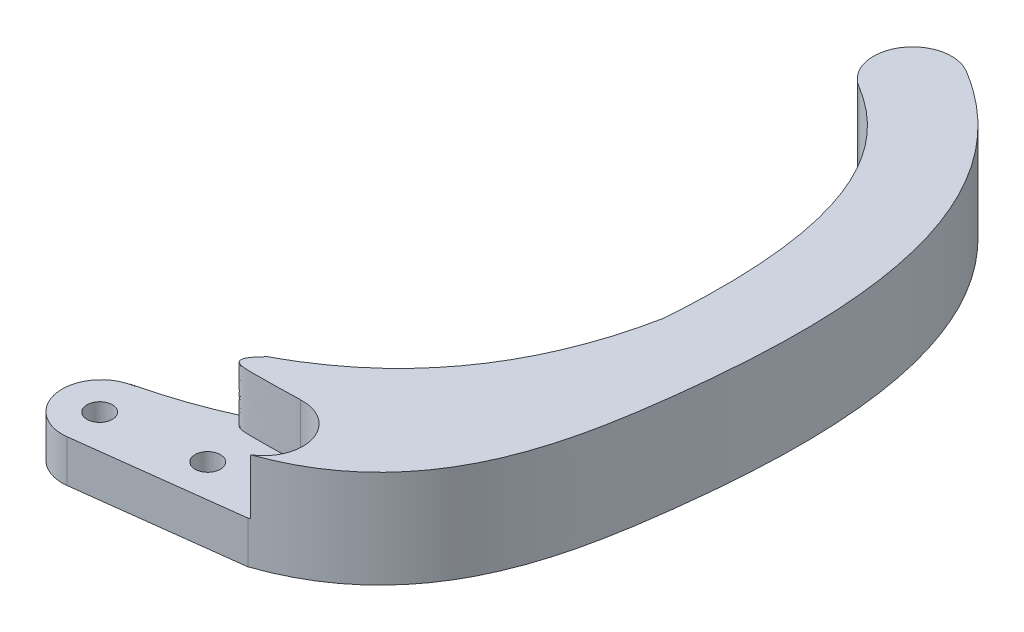
ISO-10303-21;
HEADER;
FILE_DESCRIPTION(('STEP AP214'),'2;1');
FILE_NAME('part.step','',(''),(''),'','','');
FILE_SCHEMA(('AUTOMOTIVE_DESIGN { 1 0 10303 214 1 1 1 1 }'));
ENDSEC;
DATA;
#1=APPLICATION_CONTEXT('core data for automotive mechanical design processes');
#2=APPLICATION_PROTOCOL_DEFINITION('international standard','automotive_design',2000,#1);
#3=PRODUCT_CONTEXT('',#1,'mechanical');
#4=PRODUCT('Part','Part','',(#3));
#5=PRODUCT_RELATED_PRODUCT_CATEGORY('part','',(#4));
#6=PRODUCT_DEFINITION_FORMATION('','',#4);
#7=PRODUCT_DEFINITION_CONTEXT('part definition',#1,'design');
#8=PRODUCT_DEFINITION('design','',#6,#7);
#9=PRODUCT_DEFINITION_SHAPE('','',#8);
#10=(LENGTH_UNIT() NAMED_UNIT(*) SI_UNIT(.MILLI.,.METRE.));
#11=(NAMED_UNIT(*) PLANE_ANGLE_UNIT() SI_UNIT($,.RADIAN.));
#12=(NAMED_UNIT(*) SI_UNIT($,.STERADIAN.) SOLID_ANGLE_UNIT());
#13=UNCERTAINTY_MEASURE_WITH_UNIT(LENGTH_MEASURE(1.E-05),#10,'distance_accuracy_value','');
#14=(GEOMETRIC_REPRESENTATION_CONTEXT(3) GLOBAL_UNCERTAINTY_ASSIGNED_CONTEXT((#13)) GLOBAL_UNIT_ASSIGNED_CONTEXT((#10,
#11,#12)) REPRESENTATION_CONTEXT('',''));
#15=CARTESIAN_POINT('',(0.,0.,0.));
#16=DIRECTION('',(0.,0.,1.));
#17=DIRECTION('',(1.,0.,0.));
#18=AXIS2_PLACEMENT_3D('',#15,#16,#17);
#19=CARTESIAN_POINT('',(-22.0031053075297,2.16272645112193,28.7010593362188));
#20=DIRECTION('',(0.,1.,0.));
#21=DIRECTION('',(0.,0.,1.));
#22=AXIS2_PLACEMENT_3D('',#19,#20,#21);
#23=PLANE('',#22);
#24=CARTESIAN_POINT('',(-20.0211108133601,2.16272645112193,26.7592628633793));
#25=DIRECTION('',(0.,1.,0.));
#26=DIRECTION('',(0.,0.,1.));
#27=AXIS2_PLACEMENT_3D('',#24,#25,#26);
#28=CIRCLE('',#27,0.650000000000001);
#29=CARTESIAN_POINT('',(-20.0211108133601,2.16272645112193,27.4092628633793));
#30=VERTEX_POINT('',#29);
#31=EDGE_CURVE('E208',#30,#30,#28,.T.);
#32=ORIENTED_EDGE('',*,*,#31,.F.);
#33=EDGE_LOOP('',(#32));
#34=FACE_BOUND('',#33,.T.);
#35=CARTESIAN_POINT('',(-15.04895884855,2.16272645112193,26.2047564335982));
#36=DIRECTION('',(0.,1.,0.));
#37=DIRECTION('',(0.,0.,1.));
#38=AXIS2_PLACEMENT_3D('',#35,#36,#37);
#39=CIRCLE('',#38,0.649999999999999);
#40=CARTESIAN_POINT('',(-15.04895884855,2.16272645112193,26.8547564335982));
#41=VERTEX_POINT('',#40);
#42=EDGE_CURVE('E355',#41,#41,#39,.T.);
#43=ORIENTED_EDGE('',*,*,#42,.F.);
#44=EDGE_LOOP('',(#43));
#45=FACE_BOUND('',#44,.T.);
#46=DIRECTION('',(-0.505075384915345,0.,0.863075231687607));
#47=VECTOR('',#46,1.);
#48=CARTESIAN_POINT('',(-12.4815641701559,2.16272645112193,23.7504826598374));
#49=LINE('',#48,#47);
#50=CARTESIAN_POINT('',(-12.5737473278352,2.16272645112193,23.9080056802576));
#51=VERTEX_POINT('',#50);
#52=CARTESIAN_POINT('',(-12.5808268150844,2.16272645112193,23.9201031419047));
#53=VERTEX_POINT('',#52);
#54=EDGE_CURVE('E177',#51,#53,#49,.T.);
#55=ORIENTED_EDGE('',*,*,#54,.F.);
#56=CARTESIAN_POINT('',(-15.3526385502509,2.16272645112193,22.8528473169791));
#57=CARTESIAN_POINT('',(-16.4269385478913,2.16272645112193,23.94912181987));
#58=CARTESIAN_POINT('',(-14.7009659994152,2.16272645112193,23.9638675618217));
#59=CARTESIAN_POINT('',(-13.0494889974683,2.16272645112193,23.9339152397233));
#60=CARTESIAN_POINT('',(-12.5737473278352,2.16272645112193,23.9080056802576));
#61=B_SPLINE_CURVE_WITH_KNOTS('',3,(#56,#57,#58,#59,#60),.UNSPECIFIED.,.F.,.F.,(4,1,4),(0.,
0.429888837227922,1.),.UNSPECIFIED.);
#62=CARTESIAN_POINT('',(-15.3526385503744,2.16272645112193,22.8528473170498));
#63=VERTEX_POINT('',#62);
#64=EDGE_CURVE('E148',#63,#51,#61,.T.);
#65=ORIENTED_EDGE('',*,*,#64,.F.);
#66=CARTESIAN_POINT('',(-20.4899180030866,2.16272645112194,24.7461868557851));
#67=CARTESIAN_POINT('',(-9.08556802581779,2.16272645112194,22.0034252099663));
#68=CARTESIAN_POINT('',(-6.91422073039938,2.16272645112194,11.0122515027838));
#69=B_SPLINE_CURVE_WITH_KNOTS('',2,(#66,#67,#68),.UNSPECIFIED.,.F.,.F.,(3,3),(0.,1.),.UNSPECIFIED.);
#70=CARTESIAN_POINT('',(-20.4899180030866,2.16272645112193,24.7461868557851));
#71=VERTEX_POINT('',#70);
#72=EDGE_CURVE('E218',#71,#63,#69,.T.);
#73=ORIENTED_EDGE('',*,*,#72,.F.);
#74=DIRECTION('',(-0.99235910439441,0.,0.123383175212523));
#75=VECTOR('',#74,1.);
#76=CARTESIAN_POINT('',(-20.4899180030866,2.16272645112193,24.7461868557851));
#77=LINE('',#76,#75);
#78=CARTESIAN_POINT('',(-20.2498716579538,2.16272645112193,24.7163411274297));
#79=VERTEX_POINT('',#78);
#80=EDGE_CURVE('E234',#79,#71,#77,.T.);
#81=ORIENTED_EDGE('',*,*,#80,.F.);
#82=CARTESIAN_POINT('',(-20.0031053075297,2.16272645112193,26.7010593362188));
#83=DIRECTION('',(0.,1.,0.));
#84=DIRECTION('',(0.,0.,1.));
#85=AXIS2_PLACEMENT_3D('',#82,#83,#84);
#86=CIRCLE('',#85,2.00000000000008);
#87=CARTESIAN_POINT('',(-19.7563389571046,2.16272645112193,28.6857775450076));
#88=VERTEX_POINT('',#87);
#89=EDGE_CURVE('E190',#79,#88,#86,.T.);
#90=ORIENTED_EDGE('',*,*,#89,.T.);
#91=DIRECTION('',(0.99235910439441,0.,-0.123383175212528));
#92=VECTOR('',#91,1.);
#93=CARTESIAN_POINT('',(-11.5327875652265,2.16272645112193,27.6633171496122));
#94=LINE('',#93,#92);
#95=CARTESIAN_POINT('',(-11.5327875652265,2.16272645112193,27.6633171496122));
#96=VERTEX_POINT('',#95);
#97=EDGE_CURVE('E12',#88,#96,#94,.T.);
#98=ORIENTED_EDGE('',*,*,#97,.T.);
#99=CARTESIAN_POINT('',(-11.5327875652265,2.16272645112193,27.6633171496122));
#100=CARTESIAN_POINT('',(-11.4705328840874,2.16272645112193,27.6408736134227));
#101=CARTESIAN_POINT('',(-11.3551026257132,2.16272645112193,27.5995338300038));
#102=CARTESIAN_POINT('',(-11.0516092777323,2.16272645112193,27.4884759514846));
#103=CARTESIAN_POINT('',(-10.5513437173492,2.16272645112193,27.2865539282901));
#104=CARTESIAN_POINT('',(-9.5849011476042,2.16272645112193,26.8294087655371));
#105=CARTESIAN_POINT('',(-7.85457596750125,2.16272645112193,25.725812710721));
#106=CARTESIAN_POINT('',(-5.96542890968509,2.16272645112193,23.6751103760805));
#107=CARTESIAN_POINT('',(-4.55644623408551,2.16272645112193,20.8199906366794));
#108=CARTESIAN_POINT('',(-3.73194291853068,2.16272645112193,17.7966546678477));
#109=CARTESIAN_POINT('',(-3.2575877574119,2.16272645112193,14.7429997846611));
#110=CARTESIAN_POINT('',(-2.92791896255767,2.16272645112193,11.6989351556128));
#111=CARTESIAN_POINT('',(-2.7724808230558,2.16272645112193,8.76409886953061));
#112=CARTESIAN_POINT('',(-2.84198148702445,2.16272645112193,5.20493893222024));
#113=CARTESIAN_POINT('',(-3.42508342777761,2.16272645112193,1.31817111381266));
#114=CARTESIAN_POINT('',(-4.91857020106248,2.16272645112193,-2.52848265045276));
#115=CARTESIAN_POINT('',(-7.18223334564354,2.16272645112193,-5.5753012786201));
#116=CARTESIAN_POINT('',(-9.09095939420045,2.16272645112193,-7.05327105001435));
#117=CARTESIAN_POINT('',(-10.123130175544,2.16272645112193,-7.67687423040969));
#118=B_SPLINE_CURVE_WITH_KNOTS('',3,(#99,#100,#101,#102,#103,#104,#105,#106,#107,#108,#109,#110,
#111,#112,#113,#114,#115,#116,#117),.UNSPECIFIED.,.F.,.F.,(4,1,1,1,1,1,1,1,1,1,1,1,1,1,1,1,4),
(-0.00441162090859239,-0.000488138014418203,0.00343534487975599,0.0112823106681044,
0.0269762422448011,0.0583641053981946,0.121139831704982,0.183915558011769,0.246691284318556,
0.309467010625343,0.37224273693213,0.435018463238917,0.497794189545704,0.623345642159278,
0.748897094772852,0.874448547386426,1.),.UNSPECIFIED.);
#119=CARTESIAN_POINT('',(-11.4292559025369,2.16272645112193,27.6260498510052));
#120=VERTEX_POINT('',#119);
#121=EDGE_CURVE('E193',#96,#120,#118,.T.);
#122=ORIENTED_EDGE('',*,*,#121,.T.);
#123=CARTESIAN_POINT('',(-12.4679360328548,2.16272645112193,25.9169145178958));
#124=DIRECTION('',(0.,-1.,0.));
#125=DIRECTION('',(0.,0.,1.));
#126=AXIS2_PLACEMENT_3D('',#123,#124,#125);
#127=CIRCLE('',#126,2.);
#128=EDGE_CURVE('E172',#53,#120,#127,.T.);
#129=ORIENTED_EDGE('',*,*,#128,.F.);
#130=EDGE_LOOP('',(#55,#65,#73,#81,#90,#98,#122,#129));
#131=FACE_BOUND('',#130,.T.);
#132=ADVANCED_FACE('F49',(#34,#45,#131),#23,.T.);
#133=CARTESIAN_POINT('',(-12.191592735247,5.,-4.25321206262693));
#134=CARTESIAN_POINT('',(-11.8198193891852,5.,-4.02859899938119));
#135=CARTESIAN_POINT('',(-11.0949401824415,5.,-3.5318742141137));
#136=CARTESIAN_POINT('',(-9.82904075770144,5.,-2.4019500347944));
#137=CARTESIAN_POINT('',(-8.51464943898893,5.,-0.656477940427985));
#138=CARTESIAN_POINT('',(-7.36784503395466,5.,2.19287440613812));
#139=CARTESIAN_POINT('',(-6.85417187696481,5.,5.37938730467008));
#140=CARTESIAN_POINT('',(-6.77295247229738,5.,8.47061127706377));
#141=CARTESIAN_POINT('',(-6.8936217446499,5.,11.0878044148581));
#142=CARTESIAN_POINT('',(-7.18904771517179,5.,13.9342734689505));
#143=CARTESIAN_POINT('',(-7.60219661146906,5.,16.706089730852));
#144=CARTESIAN_POINT('',(-8.23898793057363,5.,19.1641617904843));
#145=CARTESIAN_POINT('',(-9.02690746597256,5.,20.8482258635351));
#146=CARTESIAN_POINT('',(-9.83758456949521,5.,21.9461432302348));
#147=CARTESIAN_POINT('',(-10.5513906559186,5.,22.6554068387202));
#148=CARTESIAN_POINT('',(-11.2645175049673,5.,23.1620276972684));
#149=CARTESIAN_POINT('',(-11.9209499457628,5.,23.5147605424879));
#150=CARTESIAN_POINT('',(-12.295612377576,5.,23.6779658103609));
#151=CARTESIAN_POINT('',(-12.4815641701559,5.,23.7504826598374));
#152=B_SPLINE_CURVE_WITH_KNOTS('',3,(#133,#134,#135,#136,#137,#138,#139,#140,#141,#142,#143,
#144,#145,#146,#147,#148,#149,#150,#151),.UNSPECIFIED.,.F.,.F.,(4,1,1,1,1,1,1,1,1,1,1,1,1,1,1,1,
4),(0.00523823924768673,0.0674108492947063,0.129583459341726,0.253928679435765,
0.378273899529804,0.502619119623843,0.564791729670863,0.626964339717883,0.689136949764902,
0.751309559811922,0.813482169858941,0.875654779905961,0.906741084929471,0.93782738995298,
0.96891369497649,0.984456847488245,1.),.UNSPECIFIED.);
#153=DIRECTION('',(0.,-1.,0.));
#154=VECTOR('',#153,1.);
#155=SURFACE_OF_LINEAR_EXTRUSION('',#152,#154);
#156=DIRECTION('',(0.,-1.,0.));
#157=VECTOR('',#156,1.);
#158=CARTESIAN_POINT('',(-6.91422073044252,20.7974971876357,11.0122515033687));
#159=LINE('',#158,#157);
#160=CARTESIAN_POINT('',(-6.91422073044252,5.,11.0122515033687));
#161=VERTEX_POINT('',#160);
#162=CARTESIAN_POINT('',(-6.91422073039938,2.16272645112194,11.0122515027838));
#163=VERTEX_POINT('',#162);
#164=EDGE_CURVE('E70',#161,#163,#159,.T.);
#165=ORIENTED_EDGE('',*,*,#164,.F.);
#166=CARTESIAN_POINT('',(-12.191592735247,5.,-4.25321206262693));
#167=VERTEX_POINT('',#166);
#168=EDGE_CURVE('E313',#167,#161,#152,.T.);
#169=ORIENTED_EDGE('',*,*,#168,.F.);
#170=DIRECTION('',(0.,-1.,0.));
#171=VECTOR('',#170,1.);
#172=CARTESIAN_POINT('',(-12.191592735247,5.,-4.25321206262693));
#173=LINE('',#172,#171);
#174=CARTESIAN_POINT('',(-12.191592735247,0.,-4.25321206262693));
#175=VERTEX_POINT('',#174);
#176=EDGE_CURVE('E349',#167,#175,#173,.T.);
#177=ORIENTED_EDGE('',*,*,#176,.T.);
#178=CARTESIAN_POINT('',(-12.191592735247,0.,-4.25321206262693));
#179=CARTESIAN_POINT('',(-11.8198193891852,0.,-4.02859899938119));
#180=CARTESIAN_POINT('',(-11.0949401824415,0.,-3.5318742141137));
#181=CARTESIAN_POINT('',(-9.82904075770144,0.,-2.4019500347944));
#182=CARTESIAN_POINT('',(-8.51464943898893,0.,-0.656477940427985));
#183=CARTESIAN_POINT('',(-7.36784503395466,0.,2.19287440613812));
#184=CARTESIAN_POINT('',(-6.85417187696481,0.,5.37938730467008));
#185=CARTESIAN_POINT('',(-6.77295247229738,0.,8.47061127706377));
#186=CARTESIAN_POINT('',(-6.8936217446499,0.,11.0878044148581));
#187=CARTESIAN_POINT('',(-7.18904771517179,0.,13.9342734689505));
#188=CARTESIAN_POINT('',(-7.60219661146906,0.,16.706089730852));
#189=CARTESIAN_POINT('',(-8.23898793057363,0.,19.1641617904843));
#190=CARTESIAN_POINT('',(-9.02690746597256,0.,20.8482258635351));
#191=CARTESIAN_POINT('',(-9.83758456949521,0.,21.9461432302348));
#192=CARTESIAN_POINT('',(-10.5513906559186,0.,22.6554068387202));
#193=CARTESIAN_POINT('',(-11.2645175049673,0.,23.1620276972684));
#194=CARTESIAN_POINT('',(-11.9209499457628,0.,23.5147605424879));
#195=CARTESIAN_POINT('',(-12.295612377576,0.,23.6779658103609));
#196=CARTESIAN_POINT('',(-12.4815641701559,0.,23.7504826598374));
#197=B_SPLINE_CURVE_WITH_KNOTS('',3,(#178,#179,#180,#181,#182,#183,#184,#185,#186,#187,#188,
#189,#190,#191,#192,#193,#194,#195,#196),.UNSPECIFIED.,.F.,.F.,(4,1,1,1,1,1,1,1,1,1,1,1,1,1,1,1,
4),(0.00523823924768673,0.0674108492947063,0.129583459341726,0.253928679435765,
0.378273899529804,0.502619119623843,0.564791729670863,0.626964339717883,0.689136949764902,
0.751309559811922,0.813482169858941,0.875654779905961,0.906741084929471,0.93782738995298,
0.96891369497649,0.984456847488245,1.),.UNSPECIFIED.);
#198=CARTESIAN_POINT('',(-6.91422073040017,0.,11.0122515027944));
#199=VERTEX_POINT('',#198);
#200=EDGE_CURVE('E78',#175,#199,#197,.T.);
#201=ORIENTED_EDGE('',*,*,#200,.T.);
#202=DIRECTION('',(0.,-1.,0.));
#203=VECTOR('',#202,1.);
#204=CARTESIAN_POINT('',(-6.91422073035839,21.4738770310359,11.0122515022279));
#205=LINE('',#204,#203);
#206=EDGE_CURVE('E222',#163,#199,#205,.T.);
#207=ORIENTED_EDGE('',*,*,#206,.F.);
#208=EDGE_LOOP('',(#165,#169,#177,#201,#207));
#209=FACE_BOUND('',#208,.T.);
#210=ADVANCED_FACE('F270',(#209),#155,.F.);
#211=CARTESIAN_POINT('',(-12.4815641701559,10.7376050407106,23.7504826598374));
#212=DIRECTION('',(0.863075231687607,0.,0.505075384915345));
#213=DIRECTION('',(0.505075384915345,0.,-0.863075231687607));
#214=AXIS2_PLACEMENT_3D('',#211,#212,#213);
#215=PLANE('',#214);
#216=DIRECTION('',(0.,-1.,0.));
#217=VECTOR('',#216,1.);
#218=CARTESIAN_POINT('',(-12.5737473278352,20.7974971876357,23.9080056802576));
#219=LINE('',#218,#217);
#220=CARTESIAN_POINT('',(-12.5737473278352,5.,23.9080056802576));
#221=VERTEX_POINT('',#220);
#222=EDGE_CURVE('E142',#221,#51,#219,.T.);
#223=ORIENTED_EDGE('',*,*,#222,.T.);
#224=ORIENTED_EDGE('',*,*,#54,.T.);
#225=DIRECTION('',(0.,-1.,0.));
#226=VECTOR('',#225,1.);
#227=CARTESIAN_POINT('',(-12.5808268150844,10.7376050407106,23.9201031419047));
#228=LINE('',#227,#226);
#229=CARTESIAN_POINT('',(-12.5808268150844,5.,23.9201031419047));
#230=VERTEX_POINT('',#229);
#231=EDGE_CURVE('E166',#230,#53,#228,.T.);
#232=ORIENTED_EDGE('',*,*,#231,.F.);
#233=DIRECTION('',(-0.505075384915345,0.,0.863075231687607));
#234=VECTOR('',#233,1.);
#235=CARTESIAN_POINT('',(-12.4815641701559,5.,23.7504826598374));
#236=LINE('',#235,#234);
#237=EDGE_CURVE('E159',#221,#230,#236,.T.);
#238=ORIENTED_EDGE('',*,*,#237,.F.);
#239=EDGE_LOOP('',(#223,#224,#232,#238));
#240=FACE_BOUND('',#239,.T.);
#241=ADVANCED_FACE('F164',(#240),#215,.F.);
#242=CARTESIAN_POINT('',(-15.04895884855,0.,26.2047564335982));
#243=DIRECTION('',(0.,1.,0.));
#244=DIRECTION('',(0.,0.,1.));
#245=AXIS2_PLACEMENT_3D('',#242,#243,#244);
#246=CYLINDRICAL_SURFACE('',#245,0.649999999999999);
#247=ORIENTED_EDGE('',*,*,#42,.T.);
#248=EDGE_LOOP('',(#247));
#249=FACE_BOUND('',#248,.T.);
#250=CARTESIAN_POINT('',(-15.04895884855,0.85,26.2047564335982));
#251=DIRECTION('',(0.,-1.,0.));
#252=DIRECTION('',(0.,0.,-1.));
#253=AXIS2_PLACEMENT_3D('',#250,#251,#252);
#254=CIRCLE('',#253,0.649999999999999);
#255=CARTESIAN_POINT('',(-15.04895884855,0.85,25.5547564335982));
#256=VERTEX_POINT('',#255);
#257=EDGE_CURVE('E209',#256,#256,#254,.F.);
#258=ORIENTED_EDGE('',*,*,#257,.F.);
#259=EDGE_LOOP('',(#258));
#260=FACE_BOUND('',#259,.T.);
#261=ADVANCED_FACE('F269',(#249,#260),#246,.F.);
#262=CARTESIAN_POINT('',(-20.0211108133601,0.,26.7592628633793));
#263=DIRECTION('',(0.,1.,0.));
#264=DIRECTION('',(0.,0.,1.));
#265=AXIS2_PLACEMENT_3D('',#262,#263,#264);
#266=CYLINDRICAL_SURFACE('',#265,0.650000000000001);
#267=ORIENTED_EDGE('',*,*,#31,.T.);
#268=EDGE_LOOP('',(#267));
#269=FACE_BOUND('',#268,.T.);
#270=CARTESIAN_POINT('',(-20.0211108133601,0.85,26.7592628633793));
#271=DIRECTION('',(0.,-1.,0.));
#272=DIRECTION('',(0.,0.,-1.));
#273=AXIS2_PLACEMENT_3D('',#270,#271,#272);
#274=CIRCLE('',#273,0.650000000000001);
#275=CARTESIAN_POINT('',(-20.0211108133601,0.85,26.1092628633793));
#276=VERTEX_POINT('',#275);
#277=EDGE_CURVE('E181',#276,#276,#274,.F.);
#278=ORIENTED_EDGE('',*,*,#277,.F.);
#279=EDGE_LOOP('',(#278));
#280=FACE_BOUND('',#279,.T.);
#281=ADVANCED_FACE('F287',(#269,#280),#266,.F.);
#282=CARTESIAN_POINT('',(-11.5327875652265,5.,27.6633171496122));
#283=CARTESIAN_POINT('',(-11.4705328840874,5.,27.6408736134227));
#284=CARTESIAN_POINT('',(-11.3551026257132,5.,27.5995338300038));
#285=CARTESIAN_POINT('',(-11.0516092777323,5.,27.4884759514846));
#286=CARTESIAN_POINT('',(-10.5513437173492,5.,27.2865539282901));
#287=CARTESIAN_POINT('',(-9.5849011476042,5.,26.8294087655371));
#288=CARTESIAN_POINT('',(-7.85457596750125,5.,25.725812710721));
#289=CARTESIAN_POINT('',(-5.96542890968509,5.,23.6751103760805));
#290=CARTESIAN_POINT('',(-4.55644623408551,5.,20.8199906366794));
#291=CARTESIAN_POINT('',(-3.73194291853068,5.,17.7966546678477));
#292=CARTESIAN_POINT('',(-3.2575877574119,5.,14.7429997846611));
#293=CARTESIAN_POINT('',(-2.92791896255767,5.,11.6989351556128));
#294=CARTESIAN_POINT('',(-2.7724808230558,5.,8.76409886953061));
#295=CARTESIAN_POINT('',(-2.84198148702445,5.,5.20493893222024));
#296=CARTESIAN_POINT('',(-3.42508342777761,5.,1.31817111381266));
#297=CARTESIAN_POINT('',(-4.91857020106248,5.,-2.52848265045276));
#298=CARTESIAN_POINT('',(-7.18223334564354,5.,-5.5753012786201));
#299=CARTESIAN_POINT('',(-9.09095939420045,5.,-7.05327105001435));
#300=CARTESIAN_POINT('',(-10.123130175544,5.,-7.67687423040969));
#301=B_SPLINE_CURVE_WITH_KNOTS('',3,(#282,#283,#284,#285,#286,#287,#288,#289,#290,#291,#292,
#293,#294,#295,#296,#297,#298,#299,#300),.UNSPECIFIED.,.F.,.F.,(4,1,1,1,1,1,1,1,1,1,1,1,1,1,1,1,
4),(-0.00441162090859239,-0.000488138014418203,0.00343534487975599,0.0112823106681044,
0.0269762422448011,0.0583641053981946,0.121139831704982,0.183915558011769,0.246691284318556,
0.309467010625343,0.37224273693213,0.435018463238917,0.497794189545704,0.623345642159278,
0.748897094772852,0.874448547386426,1.),.UNSPECIFIED.);
#302=DIRECTION('',(0.,-1.,0.));
#303=VECTOR('',#302,1.);
#304=SURFACE_OF_LINEAR_EXTRUSION('',#301,#303);
#305=ORIENTED_EDGE('',*,*,#121,.F.);
#306=DIRECTION('',(0.,-1.,0.));
#307=VECTOR('',#306,1.);
#308=CARTESIAN_POINT('',(-11.5327875652265,5.,27.6633171496122));
#309=LINE('',#308,#307);
#310=CARTESIAN_POINT('',(-11.5327875652265,0.,27.6633171496122));
#311=VERTEX_POINT('',#310);
#312=EDGE_CURVE('E318',#96,#311,#309,.T.);
#313=ORIENTED_EDGE('',*,*,#312,.T.);
#314=CARTESIAN_POINT('',(-11.5327875652265,0.,27.6633171496122));
#315=CARTESIAN_POINT('',(-11.4705328840874,0.,27.6408736134227));
#316=CARTESIAN_POINT('',(-11.3551026257132,0.,27.5995338300038));
#317=CARTESIAN_POINT('',(-11.0516092777323,0.,27.4884759514846));
#318=CARTESIAN_POINT('',(-10.5513437173492,0.,27.2865539282901));
#319=CARTESIAN_POINT('',(-9.5849011476042,0.,26.8294087655371));
#320=CARTESIAN_POINT('',(-7.85457596750125,0.,25.725812710721));
#321=CARTESIAN_POINT('',(-5.96542890968509,0.,23.6751103760805));
#322=CARTESIAN_POINT('',(-4.55644623408551,0.,20.8199906366794));
#323=CARTESIAN_POINT('',(-3.73194291853068,0.,17.7966546678477));
#324=CARTESIAN_POINT('',(-3.2575877574119,0.,14.7429997846611));
#325=CARTESIAN_POINT('',(-2.92791896255767,0.,11.6989351556128));
#326=CARTESIAN_POINT('',(-2.7724808230558,0.,8.76409886953061));
#327=CARTESIAN_POINT('',(-2.84198148702445,0.,5.20493893222024));
#328=CARTESIAN_POINT('',(-3.42508342777761,0.,1.31817111381266));
#329=CARTESIAN_POINT('',(-4.91857020106248,0.,-2.52848265045276));
#330=CARTESIAN_POINT('',(-7.18223334564354,0.,-5.5753012786201));
#331=CARTESIAN_POINT('',(-9.09095939420045,0.,-7.05327105001435));
#332=CARTESIAN_POINT('',(-10.123130175544,0.,-7.67687423040969));
#333=B_SPLINE_CURVE_WITH_KNOTS('',3,(#314,#315,#316,#317,#318,#319,#320,#321,#322,#323,#324,
#325,#326,#327,#328,#329,#330,#331,#332),.UNSPECIFIED.,.F.,.F.,(4,1,1,1,1,1,1,1,1,1,1,1,1,1,1,1,
4),(-0.00441162090859239,-0.000488138014418203,0.00343534487975599,0.0112823106681044,
0.0269762422448011,0.0583641053981946,0.121139831704982,0.183915558011769,0.246691284318556,
0.309467010625343,0.37224273693213,0.435018463238917,0.497794189545704,0.623345642159278,
0.748897094772852,0.874448547386426,1.),.UNSPECIFIED.);
#334=CARTESIAN_POINT('',(-10.123130175544,0.,-7.67687423040969));
#335=VERTEX_POINT('',#334);
#336=EDGE_CURVE('E192',#311,#335,#333,.T.);
#337=ORIENTED_EDGE('',*,*,#336,.T.);
#338=DIRECTION('',(0.,-1.,0.));
#339=VECTOR('',#338,1.);
#340=CARTESIAN_POINT('',(-10.123130175544,5.,-7.67687423040969));
#341=LINE('',#340,#339);
#342=CARTESIAN_POINT('',(-10.123130175544,5.,-7.67687423040969));
#343=VERTEX_POINT('',#342);
#344=EDGE_CURVE('E62',#343,#335,#341,.T.);
#345=ORIENTED_EDGE('',*,*,#344,.F.);
#346=CARTESIAN_POINT('',(-11.4292559025369,5.,27.6260498510051));
#347=VERTEX_POINT('',#346);
#348=EDGE_CURVE('E197',#347,#343,#301,.T.);
#349=ORIENTED_EDGE('',*,*,#348,.F.);
#350=DIRECTION('',(0.,-1.,0.));
#351=VECTOR('',#350,1.);
#352=CARTESIAN_POINT('',(-11.4292559025369,6.45016574591626,27.6260498510051));
#353=LINE('',#352,#351);
#354=EDGE_CURVE('E168',#347,#120,#353,.T.);
#355=ORIENTED_EDGE('',*,*,#354,.T.);
#356=EDGE_LOOP('',(#305,#313,#337,#345,#349,#355));
#357=FACE_BOUND('',#356,.T.);
#358=ADVANCED_FACE('F51',(#357),#304,.F.);
#359=CARTESIAN_POINT('',(-20.0031053075297,5.,26.7010593362188));
#360=DIRECTION('',(0.,-1.,0.));
#361=DIRECTION('',(0.,0.,-1.));
#362=AXIS2_PLACEMENT_3D('',#359,#360,#361);
#363=CYLINDRICAL_SURFACE('',#362,2.00000000000008);
#364=DIRECTION('',(0.,-1.,0.));
#365=VECTOR('',#364,1.);
#366=CARTESIAN_POINT('',(-19.7563389571046,5.,28.6857775450076));
#367=LINE('',#366,#365);
#368=CARTESIAN_POINT('',(-19.7563389571046,0.,28.6857775450076));
#369=VERTEX_POINT('',#368);
#370=EDGE_CURVE('E345',#88,#369,#367,.T.);
#371=ORIENTED_EDGE('',*,*,#370,.F.);
#372=ORIENTED_EDGE('',*,*,#89,.F.);
#373=DIRECTION('',(0.,-1.,0.));
#374=VECTOR('',#373,1.);
#375=CARTESIAN_POINT('',(-20.2498716579538,5.,24.7163411274297));
#376=LINE('',#375,#374);
#377=CARTESIAN_POINT('',(-20.2498716579547,0.,24.7163411274299));
#378=VERTEX_POINT('',#377);
#379=EDGE_CURVE('E347',#79,#378,#376,.T.);
#380=ORIENTED_EDGE('',*,*,#379,.T.);
#381=CARTESIAN_POINT('',(-20.0031053075297,0.,26.7010593362188));
#382=DIRECTION('',(0.,1.,0.));
#383=DIRECTION('',(0.,0.,-1.));
#384=AXIS2_PLACEMENT_3D('',#381,#382,#383);
#385=CIRCLE('',#384,2.00000000000008);
#386=EDGE_CURVE('E335',#378,#369,#385,.T.);
#387=ORIENTED_EDGE('',*,*,#386,.T.);
#388=EDGE_LOOP('',(#371,#372,#380,#387));
#389=FACE_BOUND('',#388,.T.);
#390=ADVANCED_FACE('F306',(#389),#363,.T.);
#391=CARTESIAN_POINT('',(-11.5327875652265,5.,27.6633171496122));
#392=DIRECTION('',(-0.123383175212528,0.,-0.99235910439441));
#393=DIRECTION('',(-0.99235910439441,0.,0.123383175212528));
#394=AXIS2_PLACEMENT_3D('',#391,#392,#393);
#395=PLANE('',#394);
#396=ORIENTED_EDGE('',*,*,#97,.F.);
#397=ORIENTED_EDGE('',*,*,#370,.T.);
#398=DIRECTION('',(0.992359104394409,0.,-0.123383175212528));
#399=VECTOR('',#398,1.);
#400=CARTESIAN_POINT('',(-11.5327875652265,0.,27.6633171496122));
#401=LINE('',#400,#399);
#402=EDGE_CURVE('E341',#369,#311,#401,.T.);
#403=ORIENTED_EDGE('',*,*,#402,.T.);
#404=ORIENTED_EDGE('',*,*,#312,.F.);
#405=EDGE_LOOP('',(#396,#397,#403,#404));
#406=FACE_BOUND('',#405,.T.);
#407=ADVANCED_FACE('F300',(#406),#395,.F.);
#408=CARTESIAN_POINT('',(-2.85768806175178,5.,6.13220772342985));
#409=DIRECTION('',(0.,1.,0.));
#410=DIRECTION('',(0.,0.,1.));
#411=AXIS2_PLACEMENT_3D('',#408,#409,#410);
#412=PLANE('',#411);
#413=ORIENTED_EDGE('',*,*,#168,.T.);
#414=CARTESIAN_POINT('',(-742109.776013553,5.,-670293.422197814));
#415=CARTESIAN_POINT('',(745739.779327864,5.,666244.54765142));
#416=CARTESIAN_POINT('',(-749413.27865905,5.,-662118.120211068));
#417=B_SPLINE_CURVE_WITH_KNOTS('',2,(#414,#415,#416),.UNSPECIFIED.,.F.,.F.,(3,3),(0.,1.),.UNSPECIFIED.);
#418=CARTESIAN_POINT('',(-15.3526385503744,5.,22.8528473170498));
#419=VERTEX_POINT('',#418);
#420=EDGE_CURVE('E152',#161,#419,#417,.T.);
#421=ORIENTED_EDGE('',*,*,#420,.T.);
#422=CARTESIAN_POINT('',(-15.3526385502509,5.,22.8528473169791));
#423=CARTESIAN_POINT('',(-16.4269385478913,5.,23.94912181987));
#424=CARTESIAN_POINT('',(-14.7009659994152,5.,23.9638675618217));
#425=CARTESIAN_POINT('',(-13.0494889974683,5.,23.9339152397233));
#426=CARTESIAN_POINT('',(-12.5737473278352,5.,23.9080056802576));
#427=B_SPLINE_CURVE_WITH_KNOTS('',3,(#422,#423,#424,#425,#426),.UNSPECIFIED.,.F.,.F.,(4,1,4),
(0.,0.429888837227922,1.),.UNSPECIFIED.);
#428=EDGE_CURVE('E145',#419,#221,#427,.T.);
#429=ORIENTED_EDGE('',*,*,#428,.T.);
#430=ORIENTED_EDGE('',*,*,#237,.T.);
#431=CARTESIAN_POINT('',(-12.4679360328548,5.,25.9169145178958));
#432=DIRECTION('',(0.,1.,0.));
#433=DIRECTION('',(0.,0.,1.));
#434=AXIS2_PLACEMENT_3D('',#431,#432,#433);
#435=CIRCLE('',#434,2.);
#436=EDGE_CURVE('E167',#230,#347,#435,.F.);
#437=ORIENTED_EDGE('',*,*,#436,.T.);
#438=ORIENTED_EDGE('',*,*,#348,.T.);
#439=CARTESIAN_POINT('',(-11.1573614553955,5.,-5.9650431465183));
#440=DIRECTION('',(0.,1.,0.));
#441=DIRECTION('',(0.,0.,1.));
#442=AXIS2_PLACEMENT_3D('',#439,#440,#441);
#443=CIRCLE('',#442,2.);
#444=EDGE_CURVE('E319',#343,#167,#443,.T.);
#445=ORIENTED_EDGE('',*,*,#444,.T.);
#446=EDGE_LOOP('',(#413,#421,#429,#430,#437,#438,#445));
#447=FACE_BOUND('',#446,.T.);
#448=ADVANCED_FACE('F157',(#447),#412,.T.);
#449=CARTESIAN_POINT('',(-11.1573614553955,5.,-5.9650431465183));
#450=DIRECTION('',(0.,-1.,0.));
#451=DIRECTION('',(0.,0.,-1.));
#452=AXIS2_PLACEMENT_3D('',#449,#450,#451);
#453=CYLINDRICAL_SURFACE('',#452,2.);
#454=CARTESIAN_POINT('',(-11.1573614553955,0.,-5.9650431465183));
#455=DIRECTION('',(0.,1.,0.));
#456=DIRECTION('',(0.,0.,1.));
#457=AXIS2_PLACEMENT_3D('',#454,#455,#456);
#458=CIRCLE('',#457,2.);
#459=EDGE_CURVE('E327',#335,#175,#458,.T.);
#460=ORIENTED_EDGE('',*,*,#459,.T.);
#461=ORIENTED_EDGE('',*,*,#176,.F.);
#462=ORIENTED_EDGE('',*,*,#444,.F.);
#463=ORIENTED_EDGE('',*,*,#344,.T.);
#464=EDGE_LOOP('',(#460,#461,#462,#463));
#465=FACE_BOUND('',#464,.T.);
#466=ADVANCED_FACE('F299',(#465),#453,.T.);
#467=CARTESIAN_POINT('',(-2.85768806175178,0.,6.13220772342985));
#468=DIRECTION('',(0.,1.,0.));
#469=DIRECTION('',(0.,0.,1.));
#470=AXIS2_PLACEMENT_3D('',#467,#468,#469);
#471=PLANE('',#470);
#472=CARTESIAN_POINT('',(-20.0211108133601,0.,26.7592628633793));
#473=DIRECTION('',(0.,-1.,0.));
#474=DIRECTION('',(0.,0.,-1.));
#475=AXIS2_PLACEMENT_3D('',#472,#473,#474);
#476=CIRCLE('',#475,1.25);
#477=CARTESIAN_POINT('',(-20.0211108133601,0.,25.5092628633793));
#478=VERTEX_POINT('',#477);
#479=EDGE_CURVE('E182',#478,#478,#476,.T.);
#480=ORIENTED_EDGE('',*,*,#479,.F.);
#481=EDGE_LOOP('',(#480));
#482=FACE_BOUND('',#481,.T.);
#483=CARTESIAN_POINT('',(-15.04895884855,0.,26.2047564335982));
#484=DIRECTION('',(0.,-1.,0.));
#485=DIRECTION('',(0.,0.,-1.));
#486=AXIS2_PLACEMENT_3D('',#483,#484,#485);
#487=CIRCLE('',#486,1.25);
#488=CARTESIAN_POINT('',(-15.04895884855,0.,24.9547564335982));
#489=VERTEX_POINT('',#488);
#490=EDGE_CURVE('E185',#489,#489,#487,.T.);
#491=ORIENTED_EDGE('',*,*,#490,.F.);
#492=EDGE_LOOP('',(#491));
#493=FACE_BOUND('',#492,.T.);
#494=ORIENTED_EDGE('',*,*,#336,.F.);
#495=ORIENTED_EDGE('',*,*,#402,.F.);
#496=ORIENTED_EDGE('',*,*,#386,.F.);
#497=DIRECTION('',(-0.99235910439441,0.,0.123383175212523));
#498=VECTOR('',#497,1.);
#499=CARTESIAN_POINT('',(-20.4899180030866,0.,24.7461868557851));
#500=LINE('',#499,#498);
#501=CARTESIAN_POINT('',(-20.4899180030866,0.,24.7461868557851));
#502=VERTEX_POINT('',#501);
#503=EDGE_CURVE('E239',#378,#502,#500,.T.);
#504=ORIENTED_EDGE('',*,*,#503,.T.);
#505=CARTESIAN_POINT('',(-20.4899180030866,0.,24.7461868557851));
#506=CARTESIAN_POINT('',(-9.08556802581779,0.,22.0034252099663));
#507=CARTESIAN_POINT('',(-6.91422073039938,0.,11.0122515027838));
#508=B_SPLINE_CURVE_WITH_KNOTS('',2,(#505,#506,#507),.UNSPECIFIED.,.F.,.F.,(3,3),(0.,1.),.UNSPECIFIED.);
#509=EDGE_CURVE('E161',#502,#199,#508,.T.);
#510=ORIENTED_EDGE('',*,*,#509,.T.);
#511=ORIENTED_EDGE('',*,*,#200,.F.);
#512=ORIENTED_EDGE('',*,*,#459,.F.);
#513=EDGE_LOOP('',(#494,#495,#496,#504,#510,#511,#512));
#514=FACE_BOUND('',#513,.T.);
#515=ADVANCED_FACE('F275',(#482,#493,#514),#471,.F.);
#516=CARTESIAN_POINT('',(-20.0211108133601,0.85,26.7592628633793));
#517=DIRECTION('',(0.,-1.,0.));
#518=DIRECTION('',(0.,0.,-1.));
#519=AXIS2_PLACEMENT_3D('',#516,#517,#518);
#520=PLANE('',#519);
#521=CARTESIAN_POINT('',(-20.0211108133601,0.85,26.7592628633793));
#522=DIRECTION('',(0.,-1.,0.));
#523=DIRECTION('',(0.,0.,-1.));
#524=AXIS2_PLACEMENT_3D('',#521,#522,#523);
#525=CIRCLE('',#524,1.25);
#526=CARTESIAN_POINT('',(-20.0211108133601,0.85,25.5092628633793));
#527=VERTEX_POINT('',#526);
#528=EDGE_CURVE('E178',#527,#527,#525,.T.);
#529=ORIENTED_EDGE('',*,*,#528,.T.);
#530=EDGE_LOOP('',(#529));
#531=FACE_BOUND('',#530,.T.);
#532=ORIENTED_EDGE('',*,*,#277,.T.);
#533=EDGE_LOOP('',(#532));
#534=FACE_BOUND('',#533,.T.);
#535=ADVANCED_FACE('F271',(#531,#534),#520,.T.);
#536=CARTESIAN_POINT('',(-20.0211108133601,0.85,26.7592628633793));
#537=DIRECTION('',(0.,-1.,0.));
#538=DIRECTION('',(0.,0.,-1.));
#539=AXIS2_PLACEMENT_3D('',#536,#537,#538);
#540=CYLINDRICAL_SURFACE('',#539,1.25);
#541=ORIENTED_EDGE('',*,*,#528,.F.);
#542=EDGE_LOOP('',(#541));
#543=FACE_BOUND('',#542,.T.);
#544=ORIENTED_EDGE('',*,*,#479,.T.);
#545=EDGE_LOOP('',(#544));
#546=FACE_BOUND('',#545,.T.);
#547=ADVANCED_FACE('F274',(#543,#546),#540,.F.);
#548=CARTESIAN_POINT('',(-15.04895884855,0.85,26.2047564335982));
#549=DIRECTION('',(0.,-1.,0.));
#550=DIRECTION('',(0.,0.,-1.));
#551=AXIS2_PLACEMENT_3D('',#548,#549,#550);
#552=PLANE('',#551);
#553=CARTESIAN_POINT('',(-15.04895884855,0.85,26.2047564335982));
#554=DIRECTION('',(0.,-1.,0.));
#555=DIRECTION('',(0.,0.,-1.));
#556=AXIS2_PLACEMENT_3D('',#553,#554,#555);
#557=CIRCLE('',#556,1.25);
#558=CARTESIAN_POINT('',(-15.04895884855,0.85,24.9547564335982));
#559=VERTEX_POINT('',#558);
#560=EDGE_CURVE('E170',#559,#559,#557,.T.);
#561=ORIENTED_EDGE('',*,*,#560,.T.);
#562=EDGE_LOOP('',(#561));
#563=FACE_BOUND('',#562,.T.);
#564=ORIENTED_EDGE('',*,*,#257,.T.);
#565=EDGE_LOOP('',(#564));
#566=FACE_BOUND('',#565,.T.);
#567=ADVANCED_FACE('F279',(#563,#566),#552,.T.);
#568=CARTESIAN_POINT('',(-15.04895884855,0.85,26.2047564335982));
#569=DIRECTION('',(0.,-1.,0.));
#570=DIRECTION('',(0.,0.,-1.));
#571=AXIS2_PLACEMENT_3D('',#568,#569,#570);
#572=CYLINDRICAL_SURFACE('',#571,1.25);
#573=ORIENTED_EDGE('',*,*,#560,.F.);
#574=EDGE_LOOP('',(#573));
#575=FACE_BOUND('',#574,.T.);
#576=ORIENTED_EDGE('',*,*,#490,.T.);
#577=EDGE_LOOP('',(#576));
#578=FACE_BOUND('',#577,.T.);
#579=ADVANCED_FACE('F265',(#575,#578),#572,.F.);
#580=CARTESIAN_POINT('',(-12.4679360328548,10.7376050407106,25.9169145178958));
#581=DIRECTION('',(0.,-1.,0.));
#582=DIRECTION('',(0.,0.,-1.));
#583=AXIS2_PLACEMENT_3D('',#580,#581,#582);
#584=CYLINDRICAL_SURFACE('',#583,2.);
#585=ORIENTED_EDGE('',*,*,#436,.F.);
#586=ORIENTED_EDGE('',*,*,#231,.T.);
#587=ORIENTED_EDGE('',*,*,#128,.T.);
#588=ORIENTED_EDGE('',*,*,#354,.F.);
#589=EDGE_LOOP('',(#585,#586,#587,#588));
#590=FACE_BOUND('',#589,.T.);
#591=ADVANCED_FACE('F261',(#590),#584,.F.);
#592=CARTESIAN_POINT('',(-20.4899180030866,21.4738770310359,24.7461868557851));
#593=DIRECTION('',(0.123383175212523,0.,0.99235910439441));
#594=DIRECTION('',(0.99235910439441,0.,-0.123383175212523));
#595=AXIS2_PLACEMENT_3D('',#592,#593,#594);
#596=PLANE('',#595);
#597=ORIENTED_EDGE('',*,*,#379,.F.);
#598=ORIENTED_EDGE('',*,*,#80,.T.);
#599=DIRECTION('',(0.,-1.,0.));
#600=VECTOR('',#599,1.);
#601=CARTESIAN_POINT('',(-20.4899180030866,21.4738770310359,24.7461868557851));
#602=LINE('',#601,#600);
#603=EDGE_CURVE('E223',#71,#502,#602,.T.);
#604=ORIENTED_EDGE('',*,*,#603,.T.);
#605=ORIENTED_EDGE('',*,*,#503,.F.);
#606=EDGE_LOOP('',(#597,#598,#604,#605));
#607=FACE_BOUND('',#606,.T.);
#608=ADVANCED_FACE('F255',(#607),#596,.T.);
#609=CARTESIAN_POINT('',(-20.4899180030866,21.4738770310359,24.7461868557851));
#610=CARTESIAN_POINT('',(-9.08556802581779,21.4738770310359,22.0034252099663));
#611=CARTESIAN_POINT('',(-6.91422073039938,21.4738770310359,11.0122515027838));
#612=B_SPLINE_CURVE_WITH_KNOTS('',2,(#609,#610,#611),.UNSPECIFIED.,.F.,.F.,(3,3),(0.,1.),.UNSPECIFIED.);
#613=DIRECTION('',(0.,-1.,0.));
#614=VECTOR('',#613,1.);
#615=SURFACE_OF_LINEAR_EXTRUSION('',#612,#614);
#616=ORIENTED_EDGE('',*,*,#603,.F.);
#617=ORIENTED_EDGE('',*,*,#72,.T.);
#618=CARTESIAN_POINT('',(-742109.776013553,2.16272645112193,-670293.422197814));
#619=CARTESIAN_POINT('',(745739.779327864,2.16272645112193,666244.54765142));
#620=CARTESIAN_POINT('',(-749413.27865905,2.16272645112193,-662118.120211068));
#621=B_SPLINE_CURVE_WITH_KNOTS('',2,(#618,#619,#620),.UNSPECIFIED.,.F.,.F.,(3,3),(0.,1.),.UNSPECIFIED.);
#622=EDGE_CURVE('E387',#163,#63,#621,.T.);
#623=ORIENTED_EDGE('',*,*,#622,.F.);
#624=ORIENTED_EDGE('',*,*,#206,.T.);
#625=ORIENTED_EDGE('',*,*,#509,.F.);
#626=EDGE_LOOP('',(#616,#617,#623,#624,#625));
#627=FACE_BOUND('',#626,.T.);
#628=ADVANCED_FACE('F250',(#627),#615,.T.);
#629=CARTESIAN_POINT('',(-742109.776013553,20.7974971876357,-670293.422197814));
#630=CARTESIAN_POINT('',(745739.779327864,20.7974971876357,666244.54765142));
#631=CARTESIAN_POINT('',(-749413.27865905,20.7974971876357,-662118.120211068));
#632=B_SPLINE_CURVE_WITH_KNOTS('',2,(#629,#630,#631),.UNSPECIFIED.,.F.,.F.,(3,3),(0.,1.),.UNSPECIFIED.);
#633=DIRECTION('',(0.,-1.,0.));
#634=VECTOR('',#633,1.);
#635=SURFACE_OF_LINEAR_EXTRUSION('',#632,#634);
#636=ORIENTED_EDGE('',*,*,#420,.F.);
#637=ORIENTED_EDGE('',*,*,#164,.T.);
#638=ORIENTED_EDGE('',*,*,#622,.T.);
#639=DIRECTION('',(0.,-1.,0.));
#640=VECTOR('',#639,1.);
#641=CARTESIAN_POINT('',(-15.3526385503744,20.7974971876357,22.8528473170498));
#642=LINE('',#641,#640);
#643=EDGE_CURVE('E224',#419,#63,#642,.T.);
#644=ORIENTED_EDGE('',*,*,#643,.F.);
#645=EDGE_LOOP('',(#636,#637,#638,#644));
#646=FACE_BOUND('',#645,.T.);
#647=ADVANCED_FACE('F254',(#646),#635,.F.);
#648=CARTESIAN_POINT('',(-15.3526385502509,20.7974971876357,22.8528473169791));
#649=CARTESIAN_POINT('',(-16.4269385478913,20.7974971876357,23.94912181987));
#650=CARTESIAN_POINT('',(-14.7009659994152,20.7974971876357,23.9638675618217));
#651=CARTESIAN_POINT('',(-13.0494889974683,20.7974971876357,23.9339152397233));
#652=CARTESIAN_POINT('',(-12.5737473278352,20.7974971876357,23.9080056802576));
#653=B_SPLINE_CURVE_WITH_KNOTS('',3,(#648,#649,#650,#651,#652),.UNSPECIFIED.,.F.,.F.,(4,1,4),
(0.,0.429888837227922,1.),.UNSPECIFIED.);
#654=DIRECTION('',(0.,-1.,0.));
#655=VECTOR('',#654,1.);
#656=SURFACE_OF_LINEAR_EXTRUSION('',#653,#655);
#657=ORIENTED_EDGE('',*,*,#428,.F.);
#658=ORIENTED_EDGE('',*,*,#643,.T.);
#659=ORIENTED_EDGE('',*,*,#64,.T.);
#660=ORIENTED_EDGE('',*,*,#222,.F.);
#661=EDGE_LOOP('',(#657,#658,#659,#660));
#662=FACE_BOUND('',#661,.T.);
#663=ADVANCED_FACE('F144',(#662),#656,.F.);
#664=CLOSED_SHELL('',(#132,#210,#241,#261,#281,#358,#390,#407,#448,#466,#515,#535,#547,#567,
#579,#591,#608,#628,#647,#663));
#665=MANIFOLD_SOLID_BREP('B2',#664);
#666=ADVANCED_BREP_SHAPE_REPRESENTATION('',(#18,#665),#14);
#667=SHAPE_DEFINITION_REPRESENTATION(#9,#666);
ENDSEC;
END-ISO-10303-21;
